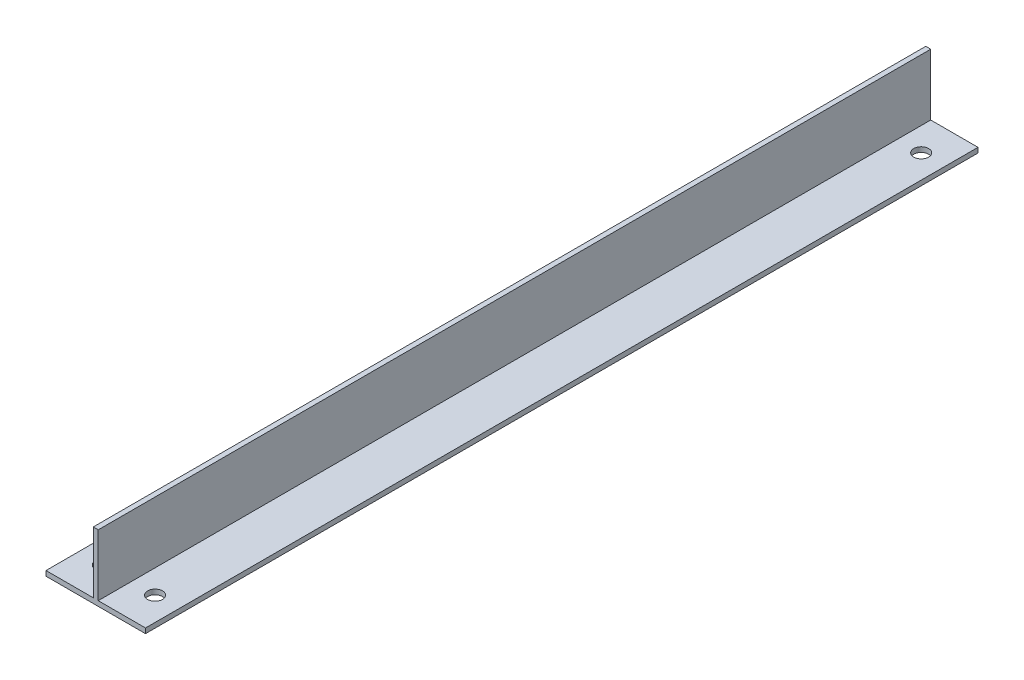
ISO-10303-21;
HEADER;
FILE_DESCRIPTION(('STEP AP214'),'2;1');
FILE_NAME('part.step','',(''),(''),'','','');
FILE_SCHEMA(('AUTOMOTIVE_DESIGN { 1 0 10303 214 1 1 1 1 }'));
ENDSEC;
DATA;
#1=APPLICATION_CONTEXT('core data for automotive mechanical design processes');
#2=APPLICATION_PROTOCOL_DEFINITION('international standard','automotive_design',2000,#1);
#3=PRODUCT_CONTEXT('',#1,'mechanical');
#4=PRODUCT('Part','Part','',(#3));
#5=PRODUCT_RELATED_PRODUCT_CATEGORY('part','',(#4));
#6=PRODUCT_DEFINITION_FORMATION('','',#4);
#7=PRODUCT_DEFINITION_CONTEXT('part definition',#1,'design');
#8=PRODUCT_DEFINITION('design','',#6,#7);
#9=PRODUCT_DEFINITION_SHAPE('','',#8);
#10=(LENGTH_UNIT() NAMED_UNIT(*) SI_UNIT(.MILLI.,.METRE.));
#11=(NAMED_UNIT(*) PLANE_ANGLE_UNIT() SI_UNIT($,.RADIAN.));
#12=(NAMED_UNIT(*) SI_UNIT($,.STERADIAN.) SOLID_ANGLE_UNIT());
#13=UNCERTAINTY_MEASURE_WITH_UNIT(LENGTH_MEASURE(1.E-05),#10,'distance_accuracy_value','');
#14=(GEOMETRIC_REPRESENTATION_CONTEXT(3) GLOBAL_UNCERTAINTY_ASSIGNED_CONTEXT((#13)) GLOBAL_UNIT_ASSIGNED_CONTEXT((#10,
#11,#12)) REPRESENTATION_CONTEXT('',''));
#15=CARTESIAN_POINT('',(0.,0.,0.));
#16=DIRECTION('',(0.,0.,1.));
#17=DIRECTION('',(1.,0.,0.));
#18=AXIS2_PLACEMENT_3D('',#15,#16,#17);
#19=CARTESIAN_POINT('',(-14.25,0.,251.));
#20=DIRECTION('',(0.,-1.,0.));
#21=DIRECTION('',(0.,0.,-1.));
#22=AXIS2_PLACEMENT_3D('',#19,#20,#21);
#23=PLANE('',#22);
#24=CARTESIAN_POINT('',(-7.125,0.,241.));
#25=DIRECTION('',(0.,1.,0.));
#26=DIRECTION('',(0.,0.,1.));
#27=AXIS2_PLACEMENT_3D('',#24,#25,#26);
#28=CIRCLE('',#27,2.25);
#29=CARTESIAN_POINT('',(-7.125,0.,243.25));
#30=VERTEX_POINT('',#29);
#31=EDGE_CURVE('E192',#30,#30,#28,.T.);
#32=ORIENTED_EDGE('',*,*,#31,.F.);
#33=EDGE_LOOP('',(#32));
#34=FACE_BOUND('',#33,.T.);
#35=CARTESIAN_POINT('',(-7.125,0.,10.));
#36=DIRECTION('',(0.,1.,0.));
#37=DIRECTION('',(0.,0.,1.));
#38=AXIS2_PLACEMENT_3D('',#35,#36,#37);
#39=CIRCLE('',#38,2.25);
#40=CARTESIAN_POINT('',(-7.125,0.,12.25));
#41=VERTEX_POINT('',#40);
#42=EDGE_CURVE('E180',#41,#41,#39,.T.);
#43=ORIENTED_EDGE('',*,*,#42,.F.);
#44=EDGE_LOOP('',(#43));
#45=FACE_BOUND('',#44,.T.);
#46=DIRECTION('',(-1.,0.,0.));
#47=VECTOR('',#46,1.);
#48=CARTESIAN_POINT('',(-14.25,0.,0.));
#49=LINE('',#48,#47);
#50=CARTESIAN_POINT('',(0.,0.,0.));
#51=VERTEX_POINT('',#50);
#52=CARTESIAN_POINT('',(-14.25,0.,0.));
#53=VERTEX_POINT('',#52);
#54=EDGE_CURVE('E132',#51,#53,#49,.T.);
#55=ORIENTED_EDGE('',*,*,#54,.T.);
#56=DIRECTION('',(0.,0.,-1.));
#57=VECTOR('',#56,1.);
#58=CARTESIAN_POINT('',(-14.25,0.,251.));
#59=LINE('',#58,#57);
#60=CARTESIAN_POINT('',(-14.25,0.,251.));
#61=VERTEX_POINT('',#60);
#62=EDGE_CURVE('E11',#61,#53,#59,.T.);
#63=ORIENTED_EDGE('',*,*,#62,.F.);
#64=DIRECTION('',(-1.,0.,0.));
#65=VECTOR('',#64,1.);
#66=CARTESIAN_POINT('',(-14.25,0.,251.));
#67=LINE('',#66,#65);
#68=CARTESIAN_POINT('',(0.,0.,251.));
#69=VERTEX_POINT('',#68);
#70=EDGE_CURVE('E147',#69,#61,#67,.T.);
#71=ORIENTED_EDGE('',*,*,#70,.F.);
#72=DIRECTION('',(0.,0.,-1.));
#73=VECTOR('',#72,1.);
#74=CARTESIAN_POINT('',(0.,0.,251.));
#75=LINE('',#74,#73);
#76=EDGE_CURVE('E128',#69,#51,#75,.T.);
#77=ORIENTED_EDGE('',*,*,#76,.T.);
#78=EDGE_LOOP('',(#55,#63,#71,#77));
#79=FACE_BOUND('',#78,.T.);
#80=ADVANCED_FACE('F36',(#34,#45,#79),#23,.F.);
#81=CARTESIAN_POINT('',(-14.25,-1.5,251.));
#82=DIRECTION('',(1.,0.,0.));
#83=DIRECTION('',(0.,1.,0.));
#84=AXIS2_PLACEMENT_3D('',#81,#82,#83);
#85=PLANE('',#84);
#86=DIRECTION('',(0.,-1.,0.));
#87=VECTOR('',#86,1.);
#88=CARTESIAN_POINT('',(-14.25,-1.5,0.));
#89=LINE('',#88,#87);
#90=CARTESIAN_POINT('',(-14.25,-1.5,0.));
#91=VERTEX_POINT('',#90);
#92=EDGE_CURVE('E135',#53,#91,#89,.T.);
#93=ORIENTED_EDGE('',*,*,#92,.T.);
#94=DIRECTION('',(0.,0.,-1.));
#95=VECTOR('',#94,1.);
#96=CARTESIAN_POINT('',(-14.25,-1.5,251.));
#97=LINE('',#96,#95);
#98=CARTESIAN_POINT('',(-14.25,-1.5,251.));
#99=VERTEX_POINT('',#98);
#100=EDGE_CURVE('E44',#99,#91,#97,.T.);
#101=ORIENTED_EDGE('',*,*,#100,.F.);
#102=DIRECTION('',(0.,-1.,0.));
#103=VECTOR('',#102,1.);
#104=CARTESIAN_POINT('',(-14.25,-1.5,251.));
#105=LINE('',#104,#103);
#106=EDGE_CURVE('E95',#61,#99,#105,.T.);
#107=ORIENTED_EDGE('',*,*,#106,.F.);
#108=ORIENTED_EDGE('',*,*,#62,.T.);
#109=EDGE_LOOP('',(#93,#101,#107,#108));
#110=FACE_BOUND('',#109,.T.);
#111=ADVANCED_FACE('F233',(#110),#85,.F.);
#112=CARTESIAN_POINT('',(15.75,-1.5,251.));
#113=DIRECTION('',(0.,1.,0.));
#114=DIRECTION('',(0.,0.,1.));
#115=AXIS2_PLACEMENT_3D('',#112,#113,#114);
#116=PLANE('',#115);
#117=CARTESIAN_POINT('',(8.62500000000003,-1.5,241.));
#118=DIRECTION('',(0.,1.,0.));
#119=DIRECTION('',(0.,0.,1.));
#120=AXIS2_PLACEMENT_3D('',#117,#118,#119);
#121=CIRCLE('',#120,2.25);
#122=CARTESIAN_POINT('',(8.62500000000003,-1.5,243.25));
#123=VERTEX_POINT('',#122);
#124=EDGE_CURVE('E195',#123,#123,#121,.T.);
#125=ORIENTED_EDGE('',*,*,#124,.T.);
#126=EDGE_LOOP('',(#125));
#127=FACE_BOUND('',#126,.T.);
#128=CARTESIAN_POINT('',(-7.125,-1.5,241.));
#129=DIRECTION('',(0.,1.,0.));
#130=DIRECTION('',(0.,0.,1.));
#131=AXIS2_PLACEMENT_3D('',#128,#129,#130);
#132=CIRCLE('',#131,2.25);
#133=CARTESIAN_POINT('',(-7.125,-1.5,243.25));
#134=VERTEX_POINT('',#133);
#135=EDGE_CURVE('E189',#134,#134,#132,.T.);
#136=ORIENTED_EDGE('',*,*,#135,.T.);
#137=EDGE_LOOP('',(#136));
#138=FACE_BOUND('',#137,.T.);
#139=CARTESIAN_POINT('',(8.625,-1.5,10.));
#140=DIRECTION('',(0.,1.,0.));
#141=DIRECTION('',(0.,0.,1.));
#142=AXIS2_PLACEMENT_3D('',#139,#140,#141);
#143=CIRCLE('',#142,2.25);
#144=CARTESIAN_POINT('',(8.625,-1.5,12.25));
#145=VERTEX_POINT('',#144);
#146=EDGE_CURVE('E183',#145,#145,#143,.T.);
#147=ORIENTED_EDGE('',*,*,#146,.T.);
#148=EDGE_LOOP('',(#147));
#149=FACE_BOUND('',#148,.T.);
#150=CARTESIAN_POINT('',(-7.125,-1.5,10.));
#151=DIRECTION('',(0.,1.,0.));
#152=DIRECTION('',(0.,0.,1.));
#153=AXIS2_PLACEMENT_3D('',#150,#151,#152);
#154=CIRCLE('',#153,2.25);
#155=CARTESIAN_POINT('',(-7.125,-1.5,12.25));
#156=VERTEX_POINT('',#155);
#157=EDGE_CURVE('E136',#156,#156,#154,.T.);
#158=ORIENTED_EDGE('',*,*,#157,.T.);
#159=EDGE_LOOP('',(#158));
#160=FACE_BOUND('',#159,.T.);
#161=DIRECTION('',(1.,0.,0.));
#162=VECTOR('',#161,1.);
#163=CARTESIAN_POINT('',(15.75,-1.5,0.));
#164=LINE('',#163,#162);
#165=CARTESIAN_POINT('',(15.75,-1.5,0.));
#166=VERTEX_POINT('',#165);
#167=EDGE_CURVE('E138',#91,#166,#164,.T.);
#168=ORIENTED_EDGE('',*,*,#167,.T.);
#169=DIRECTION('',(0.,0.,-1.));
#170=VECTOR('',#169,1.);
#171=CARTESIAN_POINT('',(15.75,-1.5,251.));
#172=LINE('',#171,#170);
#173=CARTESIAN_POINT('',(15.75,-1.5,251.));
#174=VERTEX_POINT('',#173);
#175=EDGE_CURVE('E154',#174,#166,#172,.T.);
#176=ORIENTED_EDGE('',*,*,#175,.F.);
#177=DIRECTION('',(1.,0.,0.));
#178=VECTOR('',#177,1.);
#179=CARTESIAN_POINT('',(15.75,-1.5,251.));
#180=LINE('',#179,#178);
#181=EDGE_CURVE('E162',#99,#174,#180,.T.);
#182=ORIENTED_EDGE('',*,*,#181,.F.);
#183=ORIENTED_EDGE('',*,*,#100,.T.);
#184=EDGE_LOOP('',(#168,#176,#182,#183));
#185=FACE_BOUND('',#184,.T.);
#186=ADVANCED_FACE('F160',(#127,#138,#149,#160,#185),#116,.F.);
#187=CARTESIAN_POINT('',(15.75,0.,251.));
#188=DIRECTION('',(-1.,0.,0.));
#189=DIRECTION('',(0.,0.,1.));
#190=AXIS2_PLACEMENT_3D('',#187,#188,#189);
#191=PLANE('',#190);
#192=DIRECTION('',(0.,1.,0.));
#193=VECTOR('',#192,1.);
#194=CARTESIAN_POINT('',(15.75,0.,0.));
#195=LINE('',#194,#193);
#196=CARTESIAN_POINT('',(15.75,0.,0.));
#197=VERTEX_POINT('',#196);
#198=EDGE_CURVE('E140',#166,#197,#195,.T.);
#199=ORIENTED_EDGE('',*,*,#198,.T.);
#200=DIRECTION('',(0.,0.,-1.));
#201=VECTOR('',#200,1.);
#202=CARTESIAN_POINT('',(15.75,0.,251.));
#203=LINE('',#202,#201);
#204=CARTESIAN_POINT('',(15.75,0.,251.));
#205=VERTEX_POINT('',#204);
#206=EDGE_CURVE('E151',#205,#197,#203,.T.);
#207=ORIENTED_EDGE('',*,*,#206,.F.);
#208=DIRECTION('',(0.,1.,0.));
#209=VECTOR('',#208,1.);
#210=CARTESIAN_POINT('',(15.75,0.,251.));
#211=LINE('',#210,#209);
#212=EDGE_CURVE('E174',#174,#205,#211,.T.);
#213=ORIENTED_EDGE('',*,*,#212,.F.);
#214=ORIENTED_EDGE('',*,*,#175,.T.);
#215=EDGE_LOOP('',(#199,#207,#213,#214));
#216=FACE_BOUND('',#215,.T.);
#217=ADVANCED_FACE('F170',(#216),#191,.F.);
#218=CARTESIAN_POINT('',(1.5,0.,251.));
#219=DIRECTION('',(0.,-1.,0.));
#220=DIRECTION('',(0.,0.,-1.));
#221=AXIS2_PLACEMENT_3D('',#218,#219,#220);
#222=PLANE('',#221);
#223=CARTESIAN_POINT('',(8.62500000000003,0.,241.));
#224=DIRECTION('',(0.,1.,0.));
#225=DIRECTION('',(0.,0.,1.));
#226=AXIS2_PLACEMENT_3D('',#223,#224,#225);
#227=CIRCLE('',#226,2.25);
#228=CARTESIAN_POINT('',(8.62500000000003,0.,243.25));
#229=VERTEX_POINT('',#228);
#230=EDGE_CURVE('E198',#229,#229,#227,.T.);
#231=ORIENTED_EDGE('',*,*,#230,.F.);
#232=EDGE_LOOP('',(#231));
#233=FACE_BOUND('',#232,.T.);
#234=CARTESIAN_POINT('',(8.625,0.,10.));
#235=DIRECTION('',(0.,1.,0.));
#236=DIRECTION('',(0.,0.,1.));
#237=AXIS2_PLACEMENT_3D('',#234,#235,#236);
#238=CIRCLE('',#237,2.25);
#239=CARTESIAN_POINT('',(8.625,0.,12.25));
#240=VERTEX_POINT('',#239);
#241=EDGE_CURVE('E186',#240,#240,#238,.T.);
#242=ORIENTED_EDGE('',*,*,#241,.F.);
#243=EDGE_LOOP('',(#242));
#244=FACE_BOUND('',#243,.T.);
#245=DIRECTION('',(-1.,0.,0.));
#246=VECTOR('',#245,1.);
#247=CARTESIAN_POINT('',(1.5,0.,0.));
#248=LINE('',#247,#246);
#249=CARTESIAN_POINT('',(1.5,0.,0.));
#250=VERTEX_POINT('',#249);
#251=EDGE_CURVE('E142',#197,#250,#248,.T.);
#252=ORIENTED_EDGE('',*,*,#251,.T.);
#253=DIRECTION('',(0.,0.,-1.));
#254=VECTOR('',#253,1.);
#255=CARTESIAN_POINT('',(1.5,0.,251.));
#256=LINE('',#255,#254);
#257=CARTESIAN_POINT('',(1.5,0.,251.));
#258=VERTEX_POINT('',#257);
#259=EDGE_CURVE('E123',#258,#250,#256,.T.);
#260=ORIENTED_EDGE('',*,*,#259,.F.);
#261=DIRECTION('',(-1.,0.,0.));
#262=VECTOR('',#261,1.);
#263=CARTESIAN_POINT('',(1.5,0.,251.));
#264=LINE('',#263,#262);
#265=EDGE_CURVE('E114',#205,#258,#264,.T.);
#266=ORIENTED_EDGE('',*,*,#265,.F.);
#267=ORIENTED_EDGE('',*,*,#206,.T.);
#268=EDGE_LOOP('',(#252,#260,#266,#267));
#269=FACE_BOUND('',#268,.T.);
#270=ADVANCED_FACE('F173',(#233,#244,#269),#222,.F.);
#271=CARTESIAN_POINT('',(1.5,18.5,251.));
#272=DIRECTION('',(-1.,0.,0.));
#273=DIRECTION('',(0.,0.,1.));
#274=AXIS2_PLACEMENT_3D('',#271,#272,#273);
#275=PLANE('',#274);
#276=DIRECTION('',(0.,1.,0.));
#277=VECTOR('',#276,1.);
#278=CARTESIAN_POINT('',(1.5,18.5,0.));
#279=LINE('',#278,#277);
#280=CARTESIAN_POINT('',(1.5,18.5,0.));
#281=VERTEX_POINT('',#280);
#282=EDGE_CURVE('E122',#250,#281,#279,.T.);
#283=ORIENTED_EDGE('',*,*,#282,.T.);
#284=DIRECTION('',(0.,0.,-1.));
#285=VECTOR('',#284,1.);
#286=CARTESIAN_POINT('',(1.5,18.5,251.));
#287=LINE('',#286,#285);
#288=CARTESIAN_POINT('',(1.5,18.5,251.));
#289=VERTEX_POINT('',#288);
#290=EDGE_CURVE('E119',#289,#281,#287,.T.);
#291=ORIENTED_EDGE('',*,*,#290,.F.);
#292=DIRECTION('',(0.,1.,0.));
#293=VECTOR('',#292,1.);
#294=CARTESIAN_POINT('',(1.5,18.5,251.));
#295=LINE('',#294,#293);
#296=EDGE_CURVE('E108',#258,#289,#295,.T.);
#297=ORIENTED_EDGE('',*,*,#296,.F.);
#298=ORIENTED_EDGE('',*,*,#259,.T.);
#299=EDGE_LOOP('',(#283,#291,#297,#298));
#300=FACE_BOUND('',#299,.T.);
#301=ADVANCED_FACE('F120',(#300),#275,.F.);
#302=CARTESIAN_POINT('',(0.,18.5,251.));
#303=DIRECTION('',(0.,-1.,0.));
#304=DIRECTION('',(0.,0.,-1.));
#305=AXIS2_PLACEMENT_3D('',#302,#303,#304);
#306=PLANE('',#305);
#307=DIRECTION('',(-1.,0.,0.));
#308=VECTOR('',#307,1.);
#309=CARTESIAN_POINT('',(0.,18.5,0.));
#310=LINE('',#309,#308);
#311=CARTESIAN_POINT('',(0.,18.5,0.));
#312=VERTEX_POINT('',#311);
#313=EDGE_CURVE('E81',#281,#312,#310,.T.);
#314=ORIENTED_EDGE('',*,*,#313,.T.);
#315=DIRECTION('',(0.,0.,-1.));
#316=VECTOR('',#315,1.);
#317=CARTESIAN_POINT('',(0.,18.5,251.));
#318=LINE('',#317,#316);
#319=CARTESIAN_POINT('',(0.,18.5,251.));
#320=VERTEX_POINT('',#319);
#321=EDGE_CURVE('E124',#320,#312,#318,.T.);
#322=ORIENTED_EDGE('',*,*,#321,.F.);
#323=DIRECTION('',(-1.,0.,0.));
#324=VECTOR('',#323,1.);
#325=CARTESIAN_POINT('',(0.,18.5,251.));
#326=LINE('',#325,#324);
#327=EDGE_CURVE('E112',#289,#320,#326,.T.);
#328=ORIENTED_EDGE('',*,*,#327,.F.);
#329=ORIENTED_EDGE('',*,*,#290,.T.);
#330=EDGE_LOOP('',(#314,#322,#328,#329));
#331=FACE_BOUND('',#330,.T.);
#332=ADVANCED_FACE('F126',(#331),#306,.F.);
#333=CARTESIAN_POINT('',(0.,0.,251.));
#334=DIRECTION('',(1.,0.,0.));
#335=DIRECTION('',(0.,0.,-1.));
#336=AXIS2_PLACEMENT_3D('',#333,#334,#335);
#337=PLANE('',#336);
#338=DIRECTION('',(0.,-1.,0.));
#339=VECTOR('',#338,1.);
#340=CARTESIAN_POINT('',(0.,0.,0.));
#341=LINE('',#340,#339);
#342=EDGE_CURVE('E87',#312,#51,#341,.T.);
#343=ORIENTED_EDGE('',*,*,#342,.T.);
#344=ORIENTED_EDGE('',*,*,#76,.F.);
#345=DIRECTION('',(0.,-1.,0.));
#346=VECTOR('',#345,1.);
#347=CARTESIAN_POINT('',(0.,0.,251.));
#348=LINE('',#347,#346);
#349=EDGE_CURVE('E52',#320,#69,#348,.T.);
#350=ORIENTED_EDGE('',*,*,#349,.F.);
#351=ORIENTED_EDGE('',*,*,#321,.T.);
#352=EDGE_LOOP('',(#343,#344,#350,#351));
#353=FACE_BOUND('',#352,.T.);
#354=ADVANCED_FACE('F246',(#353),#337,.F.);
#355=CARTESIAN_POINT('',(0.,0.,251.));
#356=DIRECTION('',(0.,0.,1.));
#357=DIRECTION('',(1.,0.,0.));
#358=AXIS2_PLACEMENT_3D('',#355,#356,#357);
#359=PLANE('',#358);
#360=ORIENTED_EDGE('',*,*,#70,.T.);
#361=ORIENTED_EDGE('',*,*,#106,.T.);
#362=ORIENTED_EDGE('',*,*,#181,.T.);
#363=ORIENTED_EDGE('',*,*,#212,.T.);
#364=ORIENTED_EDGE('',*,*,#265,.T.);
#365=ORIENTED_EDGE('',*,*,#296,.T.);
#366=ORIENTED_EDGE('',*,*,#327,.T.);
#367=ORIENTED_EDGE('',*,*,#349,.T.);
#368=EDGE_LOOP('',(#360,#361,#362,#363,#364,#365,#366,#367));
#369=FACE_BOUND('',#368,.T.);
#370=ADVANCED_FACE('F110',(#369),#359,.T.);
#371=CARTESIAN_POINT('',(0.,0.,0.));
#372=DIRECTION('',(0.,0.,1.));
#373=DIRECTION('',(1.,0.,0.));
#374=AXIS2_PLACEMENT_3D('',#371,#372,#373);
#375=PLANE('',#374);
#376=ORIENTED_EDGE('',*,*,#54,.F.);
#377=ORIENTED_EDGE('',*,*,#342,.F.);
#378=ORIENTED_EDGE('',*,*,#313,.F.);
#379=ORIENTED_EDGE('',*,*,#282,.F.);
#380=ORIENTED_EDGE('',*,*,#251,.F.);
#381=ORIENTED_EDGE('',*,*,#198,.F.);
#382=ORIENTED_EDGE('',*,*,#167,.F.);
#383=ORIENTED_EDGE('',*,*,#92,.F.);
#384=EDGE_LOOP('',(#376,#377,#378,#379,#380,#381,#382,#383));
#385=FACE_BOUND('',#384,.T.);
#386=ADVANCED_FACE('F166',(#385),#375,.F.);
#387=CARTESIAN_POINT('',(-7.125,-1.5,10.));
#388=DIRECTION('',(0.,1.,0.));
#389=DIRECTION('',(0.,0.,1.));
#390=AXIS2_PLACEMENT_3D('',#387,#388,#389);
#391=CYLINDRICAL_SURFACE('',#390,2.25);
#392=ORIENTED_EDGE('',*,*,#157,.F.);
#393=EDGE_LOOP('',(#392));
#394=FACE_BOUND('',#393,.T.);
#395=ORIENTED_EDGE('',*,*,#42,.T.);
#396=EDGE_LOOP('',(#395));
#397=FACE_BOUND('',#396,.T.);
#398=ADVANCED_FACE('F220',(#394,#397),#391,.F.);
#399=CARTESIAN_POINT('',(8.625,-1.5,10.));
#400=DIRECTION('',(0.,1.,0.));
#401=DIRECTION('',(0.,0.,1.));
#402=AXIS2_PLACEMENT_3D('',#399,#400,#401);
#403=CYLINDRICAL_SURFACE('',#402,2.25);
#404=ORIENTED_EDGE('',*,*,#146,.F.);
#405=EDGE_LOOP('',(#404));
#406=FACE_BOUND('',#405,.T.);
#407=ORIENTED_EDGE('',*,*,#241,.T.);
#408=EDGE_LOOP('',(#407));
#409=FACE_BOUND('',#408,.T.);
#410=ADVANCED_FACE('F218',(#406,#409),#403,.F.);
#411=CARTESIAN_POINT('',(-7.125,-1.5,241.));
#412=DIRECTION('',(0.,1.,0.));
#413=DIRECTION('',(0.,0.,1.));
#414=AXIS2_PLACEMENT_3D('',#411,#412,#413);
#415=CYLINDRICAL_SURFACE('',#414,2.25);
#416=ORIENTED_EDGE('',*,*,#135,.F.);
#417=EDGE_LOOP('',(#416));
#418=FACE_BOUND('',#417,.T.);
#419=ORIENTED_EDGE('',*,*,#31,.T.);
#420=EDGE_LOOP('',(#419));
#421=FACE_BOUND('',#420,.T.);
#422=ADVANCED_FACE('F209',(#418,#421),#415,.F.);
#423=CARTESIAN_POINT('',(8.62500000000003,-1.5,241.));
#424=DIRECTION('',(0.,1.,0.));
#425=DIRECTION('',(0.,0.,1.));
#426=AXIS2_PLACEMENT_3D('',#423,#424,#425);
#427=CYLINDRICAL_SURFACE('',#426,2.25);
#428=ORIENTED_EDGE('',*,*,#124,.F.);
#429=EDGE_LOOP('',(#428));
#430=FACE_BOUND('',#429,.T.);
#431=ORIENTED_EDGE('',*,*,#230,.T.);
#432=EDGE_LOOP('',(#431));
#433=FACE_BOUND('',#432,.T.);
#434=ADVANCED_FACE('F206',(#430,#433),#427,.F.);
#435=CLOSED_SHELL('',(#80,#111,#186,#217,#270,#301,#332,#354,#370,#386,#398,#410,#422,#434));
#436=MANIFOLD_SOLID_BREP('B2',#435);
#437=ADVANCED_BREP_SHAPE_REPRESENTATION('',(#18,#436),#14);
#438=SHAPE_DEFINITION_REPRESENTATION(#9,#437);
ENDSEC;
END-ISO-10303-21;
